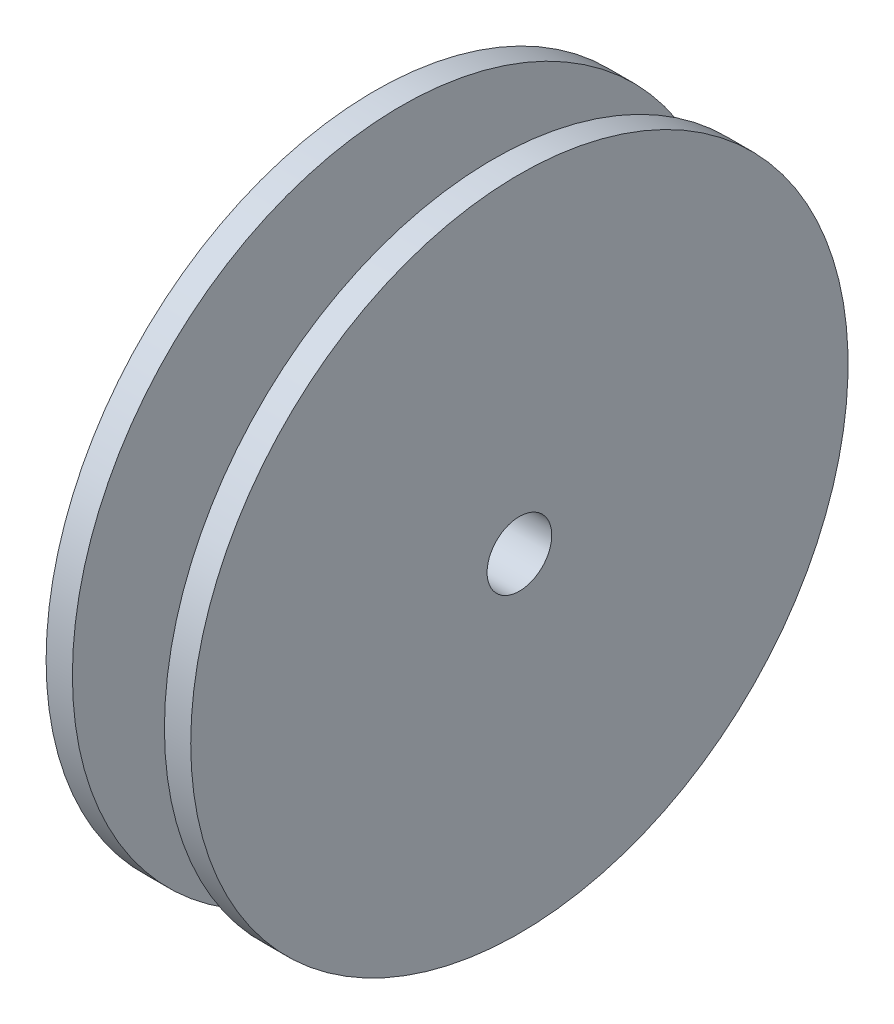
ISO-10303-21;
HEADER;
FILE_DESCRIPTION(('STEP AP214'),'2;1');
FILE_NAME('part.step','',(''),(''),'','','');
FILE_SCHEMA(('AUTOMOTIVE_DESIGN { 1 0 10303 214 1 1 1 1 }'));
ENDSEC;
DATA;
#1=APPLICATION_CONTEXT('core data for automotive mechanical design processes');
#2=APPLICATION_PROTOCOL_DEFINITION('international standard','automotive_design',2000,#1);
#3=PRODUCT_CONTEXT('',#1,'mechanical');
#4=PRODUCT('Part','Part','',(#3));
#5=PRODUCT_RELATED_PRODUCT_CATEGORY('part','',(#4));
#6=PRODUCT_DEFINITION_FORMATION('','',#4);
#7=PRODUCT_DEFINITION_CONTEXT('part definition',#1,'design');
#8=PRODUCT_DEFINITION('design','',#6,#7);
#9=PRODUCT_DEFINITION_SHAPE('','',#8);
#10=(LENGTH_UNIT() NAMED_UNIT(*) SI_UNIT(.MILLI.,.METRE.));
#11=(NAMED_UNIT(*) PLANE_ANGLE_UNIT() SI_UNIT($,.RADIAN.));
#12=(NAMED_UNIT(*) SI_UNIT($,.STERADIAN.) SOLID_ANGLE_UNIT());
#13=UNCERTAINTY_MEASURE_WITH_UNIT(LENGTH_MEASURE(1.E-05),#10,'distance_accuracy_value','');
#14=(GEOMETRIC_REPRESENTATION_CONTEXT(3) GLOBAL_UNCERTAINTY_ASSIGNED_CONTEXT((#13)) GLOBAL_UNIT_ASSIGNED_CONTEXT((#10,
#11,#12)) REPRESENTATION_CONTEXT('',''));
#15=CARTESIAN_POINT('',(0.,0.,0.));
#16=DIRECTION('',(0.,0.,1.));
#17=DIRECTION('',(1.,0.,0.));
#18=AXIS2_PLACEMENT_3D('',#15,#16,#17);
#19=CARTESIAN_POINT('',(0.,6.35,0.));
#20=DIRECTION('',(1.,0.,0.));
#21=DIRECTION('',(0.,0.,-1.));
#22=AXIS2_PLACEMENT_3D('',#19,#20,#21);
#23=PLANE('',#22);
#24=CARTESIAN_POINT('',(0.,0.,0.));
#25=DIRECTION('',(-1.,0.,0.));
#26=DIRECTION('',(0.,0.,1.));
#27=AXIS2_PLACEMENT_3D('',#24,#25,#26);
#28=CIRCLE('',#27,3.1242);
#29=CARTESIAN_POINT('',(0.,0.,3.1242));
#30=VERTEX_POINT('',#29);
#31=EDGE_CURVE('E63',#30,#30,#28,.T.);
#32=ORIENTED_EDGE('',*,*,#31,.F.);
#33=EDGE_LOOP('',(#32));
#34=FACE_BOUND('',#33,.T.);
#35=CARTESIAN_POINT('',(0.,0.,0.));
#36=DIRECTION('',(-1.,0.,0.));
#37=DIRECTION('',(0.,0.,1.));
#38=AXIS2_PLACEMENT_3D('',#35,#36,#37);
#39=CIRCLE('',#38,6.35);
#40=CARTESIAN_POINT('',(0.,0.,6.35));
#41=VERTEX_POINT('',#40);
#42=EDGE_CURVE('E59',#41,#41,#39,.T.);
#43=ORIENTED_EDGE('',*,*,#42,.T.);
#44=EDGE_LOOP('',(#43));
#45=FACE_BOUND('',#44,.T.);
#46=ADVANCED_FACE('F31',(#34,#45),#23,.F.);
#47=CARTESIAN_POINT('',(19.05,0.,0.));
#48=DIRECTION('',(-1.,0.,0.));
#49=DIRECTION('',(0.,0.,1.));
#50=AXIS2_PLACEMENT_3D('',#47,#48,#49);
#51=PLANE('',#50);
#52=CARTESIAN_POINT('',(19.05,0.,0.));
#53=DIRECTION('',(-1.,0.,0.));
#54=DIRECTION('',(0.,0.,1.));
#55=AXIS2_PLACEMENT_3D('',#52,#53,#54);
#56=CIRCLE('',#55,3.1242);
#57=CARTESIAN_POINT('',(19.05,0.,3.1242));
#58=VERTEX_POINT('',#57);
#59=EDGE_CURVE('E62',#58,#58,#56,.T.);
#60=ORIENTED_EDGE('',*,*,#59,.T.);
#61=EDGE_LOOP('',(#60));
#62=FACE_BOUND('',#61,.T.);
#63=CARTESIAN_POINT('',(19.05,0.,0.));
#64=DIRECTION('',(-1.,0.,0.));
#65=DIRECTION('',(0.,0.,1.));
#66=AXIS2_PLACEMENT_3D('',#63,#64,#65);
#67=CIRCLE('',#66,31.75);
#68=CARTESIAN_POINT('',(19.05,0.,31.75));
#69=VERTEX_POINT('',#68);
#70=EDGE_CURVE('E10',#69,#69,#67,.T.);
#71=ORIENTED_EDGE('',*,*,#70,.F.);
#72=EDGE_LOOP('',(#71));
#73=FACE_BOUND('',#72,.T.);
#74=ADVANCED_FACE('F69',(#62,#73),#51,.F.);
#75=CARTESIAN_POINT('',(0.,0.,0.));
#76=DIRECTION('',(-1.,0.,0.));
#77=DIRECTION('',(0.,0.,1.));
#78=AXIS2_PLACEMENT_3D('',#75,#76,#77);
#79=CYLINDRICAL_SURFACE('',#78,31.75);
#80=CARTESIAN_POINT('',(16.51,0.,0.));
#81=DIRECTION('',(-1.,0.,0.));
#82=DIRECTION('',(0.,0.,1.));
#83=AXIS2_PLACEMENT_3D('',#80,#81,#82);
#84=CIRCLE('',#83,31.75);
#85=CARTESIAN_POINT('',(16.51,0.,31.75));
#86=VERTEX_POINT('',#85);
#87=EDGE_CURVE('E37',#86,#86,#84,.T.);
#88=ORIENTED_EDGE('',*,*,#87,.F.);
#89=EDGE_LOOP('',(#88));
#90=FACE_BOUND('',#89,.T.);
#91=ORIENTED_EDGE('',*,*,#70,.T.);
#92=EDGE_LOOP('',(#91));
#93=FACE_BOUND('',#92,.T.);
#94=ADVANCED_FACE('F114',(#90,#93),#79,.T.);
#95=CARTESIAN_POINT('',(16.51,31.75,0.));
#96=DIRECTION('',(1.,0.,0.));
#97=DIRECTION('',(0.,0.,-1.));
#98=AXIS2_PLACEMENT_3D('',#95,#96,#97);
#99=PLANE('',#98);
#100=CARTESIAN_POINT('',(16.51,0.,0.));
#101=DIRECTION('',(-1.,0.,0.));
#102=DIRECTION('',(0.,0.,1.));
#103=AXIS2_PLACEMENT_3D('',#100,#101,#102);
#104=CIRCLE('',#103,19.05);
#105=CARTESIAN_POINT('',(16.51,0.,19.05));
#106=VERTEX_POINT('',#105);
#107=EDGE_CURVE('E41',#106,#106,#104,.T.);
#108=ORIENTED_EDGE('',*,*,#107,.F.);
#109=EDGE_LOOP('',(#108));
#110=FACE_BOUND('',#109,.T.);
#111=ORIENTED_EDGE('',*,*,#87,.T.);
#112=EDGE_LOOP('',(#111));
#113=FACE_BOUND('',#112,.T.);
#114=ADVANCED_FACE('F109',(#110,#113),#99,.F.);
#115=CARTESIAN_POINT('',(0.,0.,0.));
#116=DIRECTION('',(-1.,0.,0.));
#117=DIRECTION('',(0.,0.,1.));
#118=AXIS2_PLACEMENT_3D('',#115,#116,#117);
#119=CYLINDRICAL_SURFACE('',#118,19.05);
#120=CARTESIAN_POINT('',(7.62,0.,0.));
#121=DIRECTION('',(-1.,0.,0.));
#122=DIRECTION('',(0.,0.,1.));
#123=AXIS2_PLACEMENT_3D('',#120,#121,#122);
#124=CIRCLE('',#123,19.05);
#125=CARTESIAN_POINT('',(7.62,0.,19.05));
#126=VERTEX_POINT('',#125);
#127=EDGE_CURVE('E45',#126,#126,#124,.T.);
#128=ORIENTED_EDGE('',*,*,#127,.F.);
#129=EDGE_LOOP('',(#128));
#130=FACE_BOUND('',#129,.T.);
#131=ORIENTED_EDGE('',*,*,#107,.T.);
#132=EDGE_LOOP('',(#131));
#133=FACE_BOUND('',#132,.T.);
#134=ADVANCED_FACE('F103',(#130,#133),#119,.T.);
#135=CARTESIAN_POINT('',(7.62,19.05,0.));
#136=DIRECTION('',(-1.,0.,0.));
#137=DIRECTION('',(0.,0.,1.));
#138=AXIS2_PLACEMENT_3D('',#135,#136,#137);
#139=PLANE('',#138);
#140=CARTESIAN_POINT('',(7.62,0.,0.));
#141=DIRECTION('',(-1.,0.,0.));
#142=DIRECTION('',(0.,0.,1.));
#143=AXIS2_PLACEMENT_3D('',#140,#141,#142);
#144=CIRCLE('',#143,31.75);
#145=CARTESIAN_POINT('',(7.62,0.,31.75));
#146=VERTEX_POINT('',#145);
#147=EDGE_CURVE('E50',#146,#146,#144,.T.);
#148=ORIENTED_EDGE('',*,*,#147,.F.);
#149=EDGE_LOOP('',(#148));
#150=FACE_BOUND('',#149,.T.);
#151=ORIENTED_EDGE('',*,*,#127,.T.);
#152=EDGE_LOOP('',(#151));
#153=FACE_BOUND('',#152,.T.);
#154=ADVANCED_FACE('F97',(#150,#153),#139,.F.);
#155=CARTESIAN_POINT('',(0.,0.,0.));
#156=DIRECTION('',(-1.,0.,0.));
#157=DIRECTION('',(0.,0.,1.));
#158=AXIS2_PLACEMENT_3D('',#155,#156,#157);
#159=CYLINDRICAL_SURFACE('',#158,31.75);
#160=CARTESIAN_POINT('',(5.08,0.,0.));
#161=DIRECTION('',(-1.,0.,0.));
#162=DIRECTION('',(0.,0.,1.));
#163=AXIS2_PLACEMENT_3D('',#160,#161,#162);
#164=CIRCLE('',#163,31.75);
#165=CARTESIAN_POINT('',(5.08,0.,31.75));
#166=VERTEX_POINT('',#165);
#167=EDGE_CURVE('E53',#166,#166,#164,.T.);
#168=ORIENTED_EDGE('',*,*,#167,.F.);
#169=EDGE_LOOP('',(#168));
#170=FACE_BOUND('',#169,.T.);
#171=ORIENTED_EDGE('',*,*,#147,.T.);
#172=EDGE_LOOP('',(#171));
#173=FACE_BOUND('',#172,.T.);
#174=ADVANCED_FACE('F91',(#170,#173),#159,.T.);
#175=CARTESIAN_POINT('',(5.08,31.75,0.));
#176=DIRECTION('',(1.,0.,0.));
#177=DIRECTION('',(0.,0.,-1.));
#178=AXIS2_PLACEMENT_3D('',#175,#176,#177);
#179=PLANE('',#178);
#180=CARTESIAN_POINT('',(5.08,0.,0.));
#181=DIRECTION('',(-1.,0.,0.));
#182=DIRECTION('',(0.,0.,1.));
#183=AXIS2_PLACEMENT_3D('',#180,#181,#182);
#184=CIRCLE('',#183,6.35);
#185=CARTESIAN_POINT('',(5.08,0.,6.35));
#186=VERTEX_POINT('',#185);
#187=EDGE_CURVE('E56',#186,#186,#184,.T.);
#188=ORIENTED_EDGE('',*,*,#187,.F.);
#189=EDGE_LOOP('',(#188));
#190=FACE_BOUND('',#189,.T.);
#191=ORIENTED_EDGE('',*,*,#167,.T.);
#192=EDGE_LOOP('',(#191));
#193=FACE_BOUND('',#192,.T.);
#194=ADVANCED_FACE('F85',(#190,#193),#179,.F.);
#195=CARTESIAN_POINT('',(0.,0.,0.));
#196=DIRECTION('',(-1.,0.,0.));
#197=DIRECTION('',(0.,0.,1.));
#198=AXIS2_PLACEMENT_3D('',#195,#196,#197);
#199=CYLINDRICAL_SURFACE('',#198,6.35);
#200=ORIENTED_EDGE('',*,*,#42,.F.);
#201=EDGE_LOOP('',(#200));
#202=FACE_BOUND('',#201,.T.);
#203=ORIENTED_EDGE('',*,*,#187,.T.);
#204=EDGE_LOOP('',(#203));
#205=FACE_BOUND('',#204,.T.);
#206=ADVANCED_FACE('F75',(#202,#205),#199,.T.);
#207=CARTESIAN_POINT('',(19.05,0.,0.));
#208=DIRECTION('',(-1.,0.,0.));
#209=DIRECTION('',(0.,0.,1.));
#210=AXIS2_PLACEMENT_3D('',#207,#208,#209);
#211=CYLINDRICAL_SURFACE('',#210,3.1242);
#212=ORIENTED_EDGE('',*,*,#59,.F.);
#213=EDGE_LOOP('',(#212));
#214=FACE_BOUND('',#213,.T.);
#215=ORIENTED_EDGE('',*,*,#31,.T.);
#216=EDGE_LOOP('',(#215));
#217=FACE_BOUND('',#216,.T.);
#218=ADVANCED_FACE('F72',(#214,#217),#211,.F.);
#219=CLOSED_SHELL('',(#46,#74,#94,#114,#134,#154,#174,#194,#206,#218));
#220=MANIFOLD_SOLID_BREP('B2',#219);
#221=ADVANCED_BREP_SHAPE_REPRESENTATION('',(#18,#220),#14);
#222=SHAPE_DEFINITION_REPRESENTATION(#9,#221);
ENDSEC;
END-ISO-10303-21;
